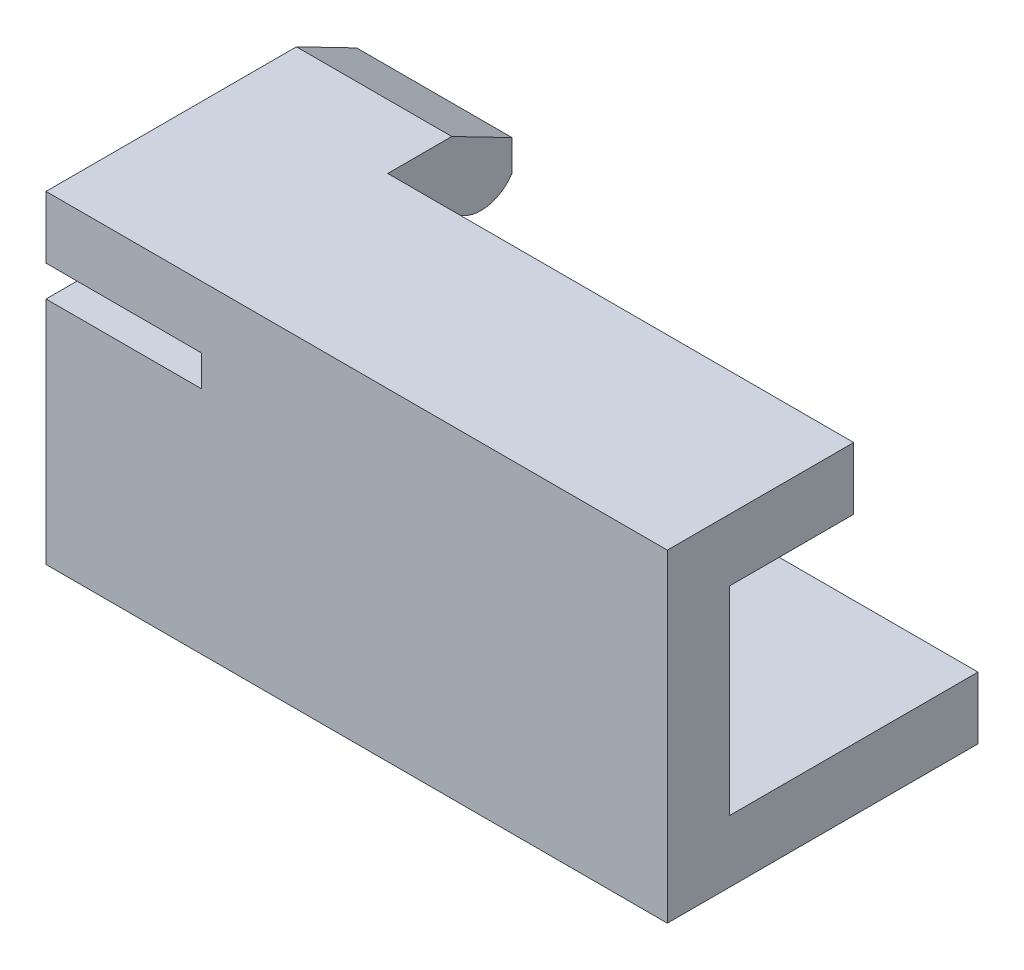
ISO-10303-21;
HEADER;
FILE_DESCRIPTION(('STEP AP214'),'2;1');
FILE_NAME('part.step','',(''),(''),'','','');
FILE_SCHEMA(('AUTOMOTIVE_DESIGN { 1 0 10303 214 1 1 1 1 }'));
ENDSEC;
DATA;
#1=APPLICATION_CONTEXT('core data for automotive mechanical design processes');
#2=APPLICATION_PROTOCOL_DEFINITION('international standard','automotive_design',2000,#1);
#3=PRODUCT_CONTEXT('',#1,'mechanical');
#4=PRODUCT('Part','Part','',(#3));
#5=PRODUCT_RELATED_PRODUCT_CATEGORY('part','',(#4));
#6=PRODUCT_DEFINITION_FORMATION('','',#4);
#7=PRODUCT_DEFINITION_CONTEXT('part definition',#1,'design');
#8=PRODUCT_DEFINITION('design','',#6,#7);
#9=PRODUCT_DEFINITION_SHAPE('','',#8);
#10=(LENGTH_UNIT() NAMED_UNIT(*) SI_UNIT(.MILLI.,.METRE.));
#11=(NAMED_UNIT(*) PLANE_ANGLE_UNIT() SI_UNIT($,.RADIAN.));
#12=(NAMED_UNIT(*) SI_UNIT($,.STERADIAN.) SOLID_ANGLE_UNIT());
#13=UNCERTAINTY_MEASURE_WITH_UNIT(LENGTH_MEASURE(1.E-05),#10,'distance_accuracy_value','');
#14=(GEOMETRIC_REPRESENTATION_CONTEXT(3) GLOBAL_UNCERTAINTY_ASSIGNED_CONTEXT((#13)) GLOBAL_UNIT_ASSIGNED_CONTEXT((#10,
#11,#12)) REPRESENTATION_CONTEXT('',''));
#15=CARTESIAN_POINT('',(0.,0.,0.));
#16=DIRECTION('',(0.,0.,1.));
#17=DIRECTION('',(1.,0.,0.));
#18=AXIS2_PLACEMENT_3D('',#15,#16,#17);
#19=CARTESIAN_POINT('',(0.,4.064,-12.7));
#20=DIRECTION('',(-1.,0.,0.));
#21=DIRECTION('',(0.,-1.,0.));
#22=AXIS2_PLACEMENT_3D('',#19,#20,#21);
#23=PLANE('',#22);
#24=DIRECTION('',(0.,1.,0.));
#25=VECTOR('',#24,1.);
#26=CARTESIAN_POINT('',(0.,4.064,-7.62));
#27=LINE('',#26,#25);
#28=CARTESIAN_POINT('',(0.,4.064,-7.62));
#29=VERTEX_POINT('',#28);
#30=CARTESIAN_POINT('',(0.,6.604,-7.62));
#31=VERTEX_POINT('',#30);
#32=EDGE_CURVE('E159',#29,#31,#27,.T.);
#33=ORIENTED_EDGE('',*,*,#32,.F.);
#34=DIRECTION('',(0.,0.,1.));
#35=VECTOR('',#34,1.);
#36=CARTESIAN_POINT('',(0.,4.064,-12.7));
#37=LINE('',#36,#35);
#38=CARTESIAN_POINT('',(0.,4.064,-10.16));
#39=VERTEX_POINT('',#38);
#40=EDGE_CURVE('E163',#39,#29,#37,.T.);
#41=ORIENTED_EDGE('',*,*,#40,.F.);
#42=CARTESIAN_POINT('',(0.,4.90642269675027,-11.43));
#43=DIRECTION('',(1.,0.,0.));
#44=DIRECTION('',(0.,-1.,0.));
#45=AXIS2_PLACEMENT_3D('',#42,#43,#44);
#46=CIRCLE('',#45,1.524);
#47=CARTESIAN_POINT('',(0.,4.064,-12.7));
#48=VERTEX_POINT('',#47);
#49=EDGE_CURVE('E162',#48,#39,#46,.F.);
#50=ORIENTED_EDGE('',*,*,#49,.F.);
#51=DIRECTION('',(0.,1.,0.));
#52=VECTOR('',#51,1.);
#53=CARTESIAN_POINT('',(0.,4.064,-12.7));
#54=LINE('',#53,#52);
#55=CARTESIAN_POINT('',(0.,5.334,-12.7));
#56=VERTEX_POINT('',#55);
#57=EDGE_CURVE('E136',#48,#56,#54,.T.);
#58=ORIENTED_EDGE('',*,*,#57,.T.);
#59=DIRECTION('',(0.,-0.458399351245607,-0.888746327574751));
#60=VECTOR('',#59,1.);
#61=CARTESIAN_POINT('',(0.,5.334,-12.7));
#62=LINE('',#61,#60);
#63=CARTESIAN_POINT('',(0.,6.604,-10.2377193860486));
#64=VERTEX_POINT('',#63);
#65=EDGE_CURVE('E220',#64,#56,#62,.T.);
#66=ORIENTED_EDGE('',*,*,#65,.F.);
#67=DIRECTION('',(0.,0.,-1.));
#68=VECTOR('',#67,1.);
#69=CARTESIAN_POINT('',(0.,6.604,-10.2377193860486));
#70=LINE('',#69,#68);
#71=EDGE_CURVE('E227',#31,#64,#70,.T.);
#72=ORIENTED_EDGE('',*,*,#71,.F.);
#73=EDGE_LOOP('',(#33,#41,#50,#58,#66,#72));
#74=FACE_BOUND('',#73,.T.);
#75=ADVANCED_FACE('F37',(#74),#23,.F.);
#76=CARTESIAN_POINT('',(0.,0.,-2.54));
#77=DIRECTION('',(0.,0.,-1.));
#78=DIRECTION('',(1.,0.,0.));
#79=AXIS2_PLACEMENT_3D('',#76,#77,#78);
#80=PLANE('',#79);
#81=DIRECTION('',(0.,1.,0.));
#82=VECTOR('',#81,1.);
#83=CARTESIAN_POINT('',(0.,0.,-2.54));
#84=LINE('',#83,#82);
#85=CARTESIAN_POINT('',(0.,2.794,-2.54));
#86=VERTEX_POINT('',#85);
#87=CARTESIAN_POINT('',(0.,4.064,-2.54));
#88=VERTEX_POINT('',#87);
#89=EDGE_CURVE('E128',#86,#88,#84,.T.);
#90=ORIENTED_EDGE('',*,*,#89,.T.);
#91=DIRECTION('',(1.,0.,0.));
#92=VECTOR('',#91,1.);
#93=CARTESIAN_POINT('',(0.,4.064,-2.54));
#94=LINE('',#93,#92);
#95=CARTESIAN_POINT('',(19.05,4.064,-2.54));
#96=VERTEX_POINT('',#95);
#97=EDGE_CURVE('E106',#88,#96,#94,.T.);
#98=ORIENTED_EDGE('',*,*,#97,.T.);
#99=DIRECTION('',(0.,-1.,0.));
#100=VECTOR('',#99,1.);
#101=CARTESIAN_POINT('',(19.05,0.,-2.54));
#102=LINE('',#101,#100);
#103=CARTESIAN_POINT('',(19.05,-4.064,-2.54));
#104=VERTEX_POINT('',#103);
#105=EDGE_CURVE('E114',#96,#104,#102,.T.);
#106=ORIENTED_EDGE('',*,*,#105,.T.);
#107=DIRECTION('',(1.,0.,0.));
#108=VECTOR('',#107,1.);
#109=CARTESIAN_POINT('',(0.,-4.064,-2.54));
#110=LINE('',#109,#108);
#111=CARTESIAN_POINT('',(-6.35,-4.064,-2.54));
#112=VERTEX_POINT('',#111);
#113=EDGE_CURVE('E156',#112,#104,#110,.T.);
#114=ORIENTED_EDGE('',*,*,#113,.F.);
#115=DIRECTION('',(0.,-1.,0.));
#116=VECTOR('',#115,1.);
#117=CARTESIAN_POINT('',(-6.35,0.,-2.54));
#118=LINE('',#117,#116);
#119=CARTESIAN_POINT('',(-6.35,2.794,-2.54));
#120=VERTEX_POINT('',#119);
#121=EDGE_CURVE('E123',#120,#112,#118,.T.);
#122=ORIENTED_EDGE('',*,*,#121,.F.);
#123=DIRECTION('',(-1.,0.,0.));
#124=VECTOR('',#123,1.);
#125=CARTESIAN_POINT('',(0.,2.794,-2.54));
#126=LINE('',#125,#124);
#127=EDGE_CURVE('E187',#86,#120,#126,.T.);
#128=ORIENTED_EDGE('',*,*,#127,.F.);
#129=EDGE_LOOP('',(#90,#98,#106,#114,#122,#128));
#130=FACE_BOUND('',#129,.T.);
#131=ADVANCED_FACE('F126',(#130),#80,.T.);
#132=CARTESIAN_POINT('',(0.,0.,0.));
#133=DIRECTION('',(0.,0.,-1.));
#134=DIRECTION('',(1.,0.,0.));
#135=AXIS2_PLACEMENT_3D('',#132,#133,#134);
#136=PLANE('',#135);
#137=DIRECTION('',(1.,0.,0.));
#138=VECTOR('',#137,1.);
#139=CARTESIAN_POINT('',(-19.8523126484497,6.60400000000001,0.));
#140=LINE('',#139,#138);
#141=CARTESIAN_POINT('',(-6.35,6.60400000000001,0.));
#142=VERTEX_POINT('',#141);
#143=CARTESIAN_POINT('',(19.05,6.60399999999999,0.));
#144=VERTEX_POINT('',#143);
#145=EDGE_CURVE('E230',#142,#144,#140,.T.);
#146=ORIENTED_EDGE('',*,*,#145,.F.);
#147=DIRECTION('',(0.,-1.,0.));
#148=VECTOR('',#147,1.);
#149=CARTESIAN_POINT('',(-6.35,0.,0.));
#150=LINE('',#149,#148);
#151=CARTESIAN_POINT('',(-6.35,4.064,0.));
#152=VERTEX_POINT('',#151);
#153=EDGE_CURVE('E124',#142,#152,#150,.T.);
#154=ORIENTED_EDGE('',*,*,#153,.T.);
#155=DIRECTION('',(-1.,0.,0.));
#156=VECTOR('',#155,1.);
#157=CARTESIAN_POINT('',(0.,4.064,0.));
#158=LINE('',#157,#156);
#159=CARTESIAN_POINT('',(0.,4.064,0.));
#160=VERTEX_POINT('',#159);
#161=EDGE_CURVE('E214',#160,#152,#158,.T.);
#162=ORIENTED_EDGE('',*,*,#161,.F.);
#163=DIRECTION('',(0.,1.,0.));
#164=VECTOR('',#163,1.);
#165=CARTESIAN_POINT('',(0.,0.,0.));
#166=LINE('',#165,#164);
#167=CARTESIAN_POINT('',(0.,2.794,0.));
#168=VERTEX_POINT('',#167);
#169=EDGE_CURVE('E11',#168,#160,#166,.T.);
#170=ORIENTED_EDGE('',*,*,#169,.F.);
#171=DIRECTION('',(-1.,0.,0.));
#172=VECTOR('',#171,1.);
#173=CARTESIAN_POINT('',(0.,2.794,0.));
#174=LINE('',#173,#172);
#175=CARTESIAN_POINT('',(-6.35,2.794,0.));
#176=VERTEX_POINT('',#175);
#177=EDGE_CURVE('E218',#168,#176,#174,.T.);
#178=ORIENTED_EDGE('',*,*,#177,.T.);
#179=CARTESIAN_POINT('',(-6.35,-6.60400000000004,0.));
#180=VERTEX_POINT('',#179);
#181=EDGE_CURVE('E144',#176,#180,#150,.T.);
#182=ORIENTED_EDGE('',*,*,#181,.T.);
#183=DIRECTION('',(1.,0.,0.));
#184=VECTOR('',#183,1.);
#185=CARTESIAN_POINT('',(-19.113342038932,-6.60400000000005,0.));
#186=LINE('',#185,#184);
#187=CARTESIAN_POINT('',(19.05,-6.604,0.));
#188=VERTEX_POINT('',#187);
#189=EDGE_CURVE('E301',#180,#188,#186,.T.);
#190=ORIENTED_EDGE('',*,*,#189,.T.);
#191=DIRECTION('',(0.,-1.,0.));
#192=VECTOR('',#191,1.);
#193=CARTESIAN_POINT('',(19.05,0.,0.));
#194=LINE('',#193,#192);
#195=EDGE_CURVE('E149',#144,#188,#194,.T.);
#196=ORIENTED_EDGE('',*,*,#195,.F.);
#197=EDGE_LOOP('',(#146,#154,#162,#170,#178,#182,#190,#196));
#198=FACE_BOUND('',#197,.T.);
#199=ADVANCED_FACE('F298',(#198),#136,.F.);
#200=CARTESIAN_POINT('',(-6.35,0.,-2.54));
#201=DIRECTION('',(1.,0.,0.));
#202=DIRECTION('',(0.,0.,1.));
#203=AXIS2_PLACEMENT_3D('',#200,#201,#202);
#204=PLANE('',#203);
#205=DIRECTION('',(0.,0.,-1.));
#206=VECTOR('',#205,1.);
#207=CARTESIAN_POINT('',(-6.35,2.794,-2.54));
#208=LINE('',#207,#206);
#209=EDGE_CURVE('E44',#176,#120,#208,.T.);
#210=ORIENTED_EDGE('',*,*,#209,.T.);
#211=ORIENTED_EDGE('',*,*,#121,.T.);
#212=DIRECTION('',(0.,0.,1.));
#213=VECTOR('',#212,1.);
#214=CARTESIAN_POINT('',(-6.35,-4.064,-7.62));
#215=LINE('',#214,#213);
#216=CARTESIAN_POINT('',(-6.35,-4.064,-12.700000000109));
#217=VERTEX_POINT('',#216);
#218=EDGE_CURVE('E129',#217,#112,#215,.T.);
#219=ORIENTED_EDGE('',*,*,#218,.F.);
#220=DIRECTION('',(0.,1.,0.));
#221=VECTOR('',#220,1.);
#222=CARTESIAN_POINT('',(-6.35,0.,-12.6999999999953));
#223=LINE('',#222,#221);
#224=CARTESIAN_POINT('',(-6.35,-6.60400000000004,-12.700000000109));
#225=VERTEX_POINT('',#224);
#226=EDGE_CURVE('E154',#225,#217,#223,.T.);
#227=ORIENTED_EDGE('',*,*,#226,.F.);
#228=DIRECTION('',(0.,0.,-1.));
#229=VECTOR('',#228,1.);
#230=CARTESIAN_POINT('',(-6.35,-6.60400000000004,-12.700000000109));
#231=LINE('',#230,#229);
#232=EDGE_CURVE('E247',#180,#225,#231,.T.);
#233=ORIENTED_EDGE('',*,*,#232,.F.);
#234=ORIENTED_EDGE('',*,*,#181,.F.);
#235=EDGE_LOOP('',(#210,#211,#219,#227,#233,#234));
#236=FACE_BOUND('',#235,.T.);
#237=ADVANCED_FACE('F194',(#236),#204,.F.);
#238=CARTESIAN_POINT('',(0.,0.,-7.62));
#239=DIRECTION('',(0.,0.,-1.));
#240=DIRECTION('',(1.,0.,0.));
#241=AXIS2_PLACEMENT_3D('',#238,#239,#240);
#242=PLANE('',#241);
#243=DIRECTION('',(0.,1.,0.));
#244=VECTOR('',#243,1.);
#245=CARTESIAN_POINT('',(19.05,0.,-7.62));
#246=LINE('',#245,#244);
#247=CARTESIAN_POINT('',(19.05,4.064,-7.62));
#248=VERTEX_POINT('',#247);
#249=CARTESIAN_POINT('',(19.05,6.60399999999999,-7.62));
#250=VERTEX_POINT('',#249);
#251=EDGE_CURVE('E111',#248,#250,#246,.T.);
#252=ORIENTED_EDGE('',*,*,#251,.F.);
#253=DIRECTION('',(1.,0.,0.));
#254=VECTOR('',#253,1.);
#255=CARTESIAN_POINT('',(0.,4.064,-7.62));
#256=LINE('',#255,#254);
#257=EDGE_CURVE('E59',#29,#248,#256,.T.);
#258=ORIENTED_EDGE('',*,*,#257,.F.);
#259=ORIENTED_EDGE('',*,*,#32,.T.);
#260=DIRECTION('',(-1.,0.,0.));
#261=VECTOR('',#260,1.);
#262=CARTESIAN_POINT('',(26.7751084134787,6.60399999999999,-7.62));
#263=LINE('',#262,#261);
#264=EDGE_CURVE('E209',#250,#31,#263,.T.);
#265=ORIENTED_EDGE('',*,*,#264,.F.);
#266=EDGE_LOOP('',(#252,#258,#259,#265));
#267=FACE_BOUND('',#266,.T.);
#268=ADVANCED_FACE('F300',(#267),#242,.T.);
#269=CARTESIAN_POINT('',(19.05,0.,-2.54));
#270=DIRECTION('',(1.,0.,0.));
#271=DIRECTION('',(0.,1.,0.));
#272=AXIS2_PLACEMENT_3D('',#269,#270,#271);
#273=PLANE('',#272);
#274=ORIENTED_EDGE('',*,*,#195,.T.);
#275=DIRECTION('',(0.,0.,1.));
#276=VECTOR('',#275,1.);
#277=CARTESIAN_POINT('',(19.05,-6.604,-12.700000000109));
#278=LINE('',#277,#276);
#279=CARTESIAN_POINT('',(19.05,-6.604,-12.700000000109));
#280=VERTEX_POINT('',#279);
#281=EDGE_CURVE('E306',#280,#188,#278,.T.);
#282=ORIENTED_EDGE('',*,*,#281,.F.);
#283=DIRECTION('',(0.,-1.,0.));
#284=VECTOR('',#283,1.);
#285=CARTESIAN_POINT('',(19.05,0.,-12.6999999999953));
#286=LINE('',#285,#284);
#287=CARTESIAN_POINT('',(19.05,-4.064,-12.700000000109));
#288=VERTEX_POINT('',#287);
#289=EDGE_CURVE('E151',#288,#280,#286,.T.);
#290=ORIENTED_EDGE('',*,*,#289,.F.);
#291=DIRECTION('',(0.,0.,1.));
#292=VECTOR('',#291,1.);
#293=CARTESIAN_POINT('',(19.05,-4.064,-7.62));
#294=LINE('',#293,#292);
#295=EDGE_CURVE('E119',#288,#104,#294,.T.);
#296=ORIENTED_EDGE('',*,*,#295,.T.);
#297=ORIENTED_EDGE('',*,*,#105,.F.);
#298=DIRECTION('',(0.,0.,1.));
#299=VECTOR('',#298,1.);
#300=CARTESIAN_POINT('',(19.05,4.064,-7.62));
#301=LINE('',#300,#299);
#302=EDGE_CURVE('E101',#248,#96,#301,.T.);
#303=ORIENTED_EDGE('',*,*,#302,.F.);
#304=ORIENTED_EDGE('',*,*,#251,.T.);
#305=DIRECTION('',(0.,0.,-1.));
#306=VECTOR('',#305,1.);
#307=CARTESIAN_POINT('',(19.05,6.60399999999999,-7.62));
#308=LINE('',#307,#306);
#309=EDGE_CURVE('E205',#144,#250,#308,.T.);
#310=ORIENTED_EDGE('',*,*,#309,.F.);
#311=EDGE_LOOP('',(#274,#282,#290,#296,#297,#303,#304,#310));
#312=FACE_BOUND('',#311,.T.);
#313=ADVANCED_FACE('F116',(#312),#273,.T.);
#314=ORIENTED_EDGE('',*,*,#153,.F.);
#315=DIRECTION('',(0.,0.,1.));
#316=VECTOR('',#315,1.);
#317=CARTESIAN_POINT('',(-6.35,6.604,-10.2377193860486));
#318=LINE('',#317,#316);
#319=CARTESIAN_POINT('',(-6.35,6.604,-10.2377193860486));
#320=VERTEX_POINT('',#319);
#321=EDGE_CURVE('E221',#320,#142,#318,.T.);
#322=ORIENTED_EDGE('',*,*,#321,.F.);
#323=DIRECTION('',(0.,0.458399351245606,0.888746327574751));
#324=VECTOR('',#323,1.);
#325=CARTESIAN_POINT('',(-6.35,5.334,-12.7));
#326=LINE('',#325,#324);
#327=CARTESIAN_POINT('',(-6.35,5.334,-12.7));
#328=VERTEX_POINT('',#327);
#329=EDGE_CURVE('E155',#328,#320,#326,.T.);
#330=ORIENTED_EDGE('',*,*,#329,.F.);
#331=DIRECTION('',(0.,-1.,0.));
#332=VECTOR('',#331,1.);
#333=CARTESIAN_POINT('',(-6.35,4.064,-12.7));
#334=LINE('',#333,#332);
#335=CARTESIAN_POINT('',(-6.35,4.064,-12.7));
#336=VERTEX_POINT('',#335);
#337=EDGE_CURVE('E161',#328,#336,#334,.T.);
#338=ORIENTED_EDGE('',*,*,#337,.T.);
#339=CARTESIAN_POINT('',(-6.35,4.90642269675027,-11.43));
#340=DIRECTION('',(1.,0.,0.));
#341=DIRECTION('',(0.,0.,1.));
#342=AXIS2_PLACEMENT_3D('',#339,#340,#341);
#343=CIRCLE('',#342,1.524);
#344=CARTESIAN_POINT('',(-6.35,4.064,-10.16));
#345=VERTEX_POINT('',#344);
#346=EDGE_CURVE('E168',#345,#336,#343,.T.);
#347=ORIENTED_EDGE('',*,*,#346,.F.);
#348=DIRECTION('',(0.,0.,1.));
#349=VECTOR('',#348,1.);
#350=CARTESIAN_POINT('',(-6.35,4.064,-7.62));
#351=LINE('',#350,#349);
#352=EDGE_CURVE('E110',#345,#152,#351,.T.);
#353=ORIENTED_EDGE('',*,*,#352,.T.);
#354=EDGE_LOOP('',(#314,#322,#330,#338,#347,#353));
#355=FACE_BOUND('',#354,.T.);
#356=ADVANCED_FACE('F284',(#355),#204,.F.);
#357=CARTESIAN_POINT('',(0.,4.064,-7.62));
#358=DIRECTION('',(0.,1.,0.));
#359=DIRECTION('',(0.,0.,-1.));
#360=AXIS2_PLACEMENT_3D('',#357,#358,#359);
#361=PLANE('',#360);
#362=ORIENTED_EDGE('',*,*,#352,.F.);
#363=DIRECTION('',(-1.,0.,0.));
#364=VECTOR('',#363,1.);
#365=CARTESIAN_POINT('',(0.0898569581452811,4.064,-10.16));
#366=LINE('',#365,#364);
#367=EDGE_CURVE('E164',#39,#345,#366,.T.);
#368=ORIENTED_EDGE('',*,*,#367,.F.);
#369=ORIENTED_EDGE('',*,*,#40,.T.);
#370=ORIENTED_EDGE('',*,*,#257,.T.);
#371=ORIENTED_EDGE('',*,*,#302,.T.);
#372=ORIENTED_EDGE('',*,*,#97,.F.);
#373=DIRECTION('',(0.,0.,-1.));
#374=VECTOR('',#373,1.);
#375=CARTESIAN_POINT('',(0.,4.064,3.556));
#376=LINE('',#375,#374);
#377=EDGE_CURVE('E50',#160,#88,#376,.T.);
#378=ORIENTED_EDGE('',*,*,#377,.F.);
#379=ORIENTED_EDGE('',*,*,#161,.T.);
#380=EDGE_LOOP('',(#362,#368,#369,#370,#371,#372,#378,#379));
#381=FACE_BOUND('',#380,.T.);
#382=ADVANCED_FACE('F104',(#381),#361,.F.);
#383=CARTESIAN_POINT('',(0.,-4.064,-7.62));
#384=DIRECTION('',(0.,1.,0.));
#385=DIRECTION('',(0.,0.,-1.));
#386=AXIS2_PLACEMENT_3D('',#383,#384,#385);
#387=PLANE('',#386);
#388=ORIENTED_EDGE('',*,*,#113,.T.);
#389=ORIENTED_EDGE('',*,*,#295,.F.);
#390=DIRECTION('',(-1.,0.,0.));
#391=VECTOR('',#390,1.);
#392=CARTESIAN_POINT('',(0.,-4.064,-12.6999999999953));
#393=LINE('',#392,#391);
#394=EDGE_CURVE('E170',#288,#217,#393,.T.);
#395=ORIENTED_EDGE('',*,*,#394,.T.);
#396=ORIENTED_EDGE('',*,*,#218,.T.);
#397=EDGE_LOOP('',(#388,#389,#395,#396));
#398=FACE_BOUND('',#397,.T.);
#399=ADVANCED_FACE('F179',(#398),#387,.T.);
#400=CARTESIAN_POINT('',(0.,0.,-12.7));
#401=DIRECTION('',(0.,0.,1.));
#402=DIRECTION('',(-1.,0.,0.));
#403=AXIS2_PLACEMENT_3D('',#400,#401,#402);
#404=PLANE('',#403);
#405=ORIENTED_EDGE('',*,*,#337,.F.);
#406=DIRECTION('',(-1.,0.,0.));
#407=VECTOR('',#406,1.);
#408=CARTESIAN_POINT('',(-6.35,5.334,-12.7));
#409=LINE('',#408,#407);
#410=EDGE_CURVE('E85',#56,#328,#409,.T.);
#411=ORIENTED_EDGE('',*,*,#410,.F.);
#412=ORIENTED_EDGE('',*,*,#57,.F.);
#413=DIRECTION('',(1.,0.,0.));
#414=VECTOR('',#413,1.);
#415=CARTESIAN_POINT('',(-6.35,4.064,-12.7));
#416=LINE('',#415,#414);
#417=EDGE_CURVE('E76',#336,#48,#416,.T.);
#418=ORIENTED_EDGE('',*,*,#417,.F.);
#419=EDGE_LOOP('',(#405,#411,#412,#418));
#420=FACE_BOUND('',#419,.T.);
#421=ADVANCED_FACE('F277',(#420),#404,.F.);
#422=CARTESIAN_POINT('',(0.0898569581452811,4.90642269675027,-11.43));
#423=DIRECTION('',(-1.,0.,0.));
#424=DIRECTION('',(0.,0.,-1.));
#425=AXIS2_PLACEMENT_3D('',#422,#423,#424);
#426=CYLINDRICAL_SURFACE('',#425,1.524);
#427=ORIENTED_EDGE('',*,*,#49,.T.);
#428=ORIENTED_EDGE('',*,*,#367,.T.);
#429=ORIENTED_EDGE('',*,*,#346,.T.);
#430=ORIENTED_EDGE('',*,*,#417,.T.);
#431=EDGE_LOOP('',(#427,#428,#429,#430));
#432=FACE_BOUND('',#431,.T.);
#433=ADVANCED_FACE('F281',(#432),#426,.T.);
#434=CARTESIAN_POINT('',(0.,0.,-12.7));
#435=DIRECTION('',(0.,0.,1.));
#436=DIRECTION('',(-1.,0.,0.));
#437=AXIS2_PLACEMENT_3D('',#434,#435,#436);
#438=PLANE('',#437);
#439=ORIENTED_EDGE('',*,*,#394,.F.);
#440=ORIENTED_EDGE('',*,*,#289,.T.);
#441=DIRECTION('',(1.,0.,0.));
#442=VECTOR('',#441,1.);
#443=CARTESIAN_POINT('',(-19.113342038932,-6.60400000000005,-12.700000000109));
#444=LINE('',#443,#442);
#445=EDGE_CURVE('E244',#225,#280,#444,.T.);
#446=ORIENTED_EDGE('',*,*,#445,.F.);
#447=ORIENTED_EDGE('',*,*,#226,.T.);
#448=EDGE_LOOP('',(#439,#440,#446,#447));
#449=FACE_BOUND('',#448,.T.);
#450=ADVANCED_FACE('F241',(#449),#438,.F.);
#451=CARTESIAN_POINT('',(-19.8523126484497,5.33400000000001,-12.7));
#452=DIRECTION('',(0.,0.888746327574751,-0.458399351245606));
#453=DIRECTION('',(0.,-0.458399351245606,-0.888746327574751));
#454=AXIS2_PLACEMENT_3D('',#451,#452,#453);
#455=PLANE('',#454);
#456=ORIENTED_EDGE('',*,*,#329,.T.);
#457=DIRECTION('',(1.,0.,0.));
#458=VECTOR('',#457,1.);
#459=CARTESIAN_POINT('',(-19.8523126484497,6.60400000000001,-10.2377193860486));
#460=LINE('',#459,#458);
#461=EDGE_CURVE('E224',#320,#64,#460,.T.);
#462=ORIENTED_EDGE('',*,*,#461,.T.);
#463=ORIENTED_EDGE('',*,*,#65,.T.);
#464=ORIENTED_EDGE('',*,*,#410,.T.);
#465=EDGE_LOOP('',(#456,#462,#463,#464));
#466=FACE_BOUND('',#465,.T.);
#467=ADVANCED_FACE('F286',(#466),#455,.T.);
#468=CARTESIAN_POINT('',(-19.8523126484497,6.60400000000001,-10.2377193860486));
#469=DIRECTION('',(0.,1.,0.));
#470=DIRECTION('',(-1.,0.,0.));
#471=AXIS2_PLACEMENT_3D('',#468,#469,#470);
#472=PLANE('',#471);
#473=ORIENTED_EDGE('',*,*,#321,.T.);
#474=ORIENTED_EDGE('',*,*,#145,.T.);
#475=ORIENTED_EDGE('',*,*,#309,.T.);
#476=ORIENTED_EDGE('',*,*,#264,.T.);
#477=ORIENTED_EDGE('',*,*,#71,.T.);
#478=ORIENTED_EDGE('',*,*,#461,.F.);
#479=EDGE_LOOP('',(#473,#474,#475,#476,#477,#478));
#480=FACE_BOUND('',#479,.T.);
#481=ADVANCED_FACE('F290',(#480),#472,.T.);
#482=CARTESIAN_POINT('',(0.,0.,3.556));
#483=DIRECTION('',(1.,0.,0.));
#484=DIRECTION('',(0.,1.,0.));
#485=AXIS2_PLACEMENT_3D('',#482,#483,#484);
#486=PLANE('',#485);
#487=DIRECTION('',(0.,0.,-1.));
#488=VECTOR('',#487,1.);
#489=CARTESIAN_POINT('',(0.,2.794,3.556));
#490=LINE('',#489,#488);
#491=EDGE_CURVE('E204',#168,#86,#490,.T.);
#492=ORIENTED_EDGE('',*,*,#491,.F.);
#493=ORIENTED_EDGE('',*,*,#169,.T.);
#494=ORIENTED_EDGE('',*,*,#377,.T.);
#495=ORIENTED_EDGE('',*,*,#89,.F.);
#496=EDGE_LOOP('',(#492,#493,#494,#495));
#497=FACE_BOUND('',#496,.T.);
#498=ADVANCED_FACE('F313',(#497),#486,.F.);
#499=CARTESIAN_POINT('',(0.,2.794,3.556));
#500=DIRECTION('',(0.,1.,0.));
#501=DIRECTION('',(0.,0.,-1.));
#502=AXIS2_PLACEMENT_3D('',#499,#500,#501);
#503=PLANE('',#502);
#504=ORIENTED_EDGE('',*,*,#177,.F.);
#505=ORIENTED_EDGE('',*,*,#491,.T.);
#506=ORIENTED_EDGE('',*,*,#127,.T.);
#507=ORIENTED_EDGE('',*,*,#209,.F.);
#508=EDGE_LOOP('',(#504,#505,#506,#507));
#509=FACE_BOUND('',#508,.T.);
#510=ADVANCED_FACE('F202',(#509),#503,.T.);
#511=CARTESIAN_POINT('',(-19.113342038932,-6.60400000000005,-12.700000000109));
#512=DIRECTION('',(0.,-1.,0.));
#513=DIRECTION('',(1.,0.,0.));
#514=AXIS2_PLACEMENT_3D('',#511,#512,#513);
#515=PLANE('',#514);
#516=ORIENTED_EDGE('',*,*,#232,.T.);
#517=ORIENTED_EDGE('',*,*,#445,.T.);
#518=ORIENTED_EDGE('',*,*,#281,.T.);
#519=ORIENTED_EDGE('',*,*,#189,.F.);
#520=EDGE_LOOP('',(#516,#517,#518,#519));
#521=FACE_BOUND('',#520,.T.);
#522=ADVANCED_FACE('F310',(#521),#515,.T.);
#523=CLOSED_SHELL('',(#75,#131,#199,#237,#268,#313,#356,#382,#399,#421,#433,#450,#467,#481,#498,
#510,#522));
#524=MANIFOLD_SOLID_BREP('B2',#523);
#525=ADVANCED_BREP_SHAPE_REPRESENTATION('',(#18,#524),#14);
#526=SHAPE_DEFINITION_REPRESENTATION(#9,#525);
ENDSEC;
END-ISO-10303-21;
